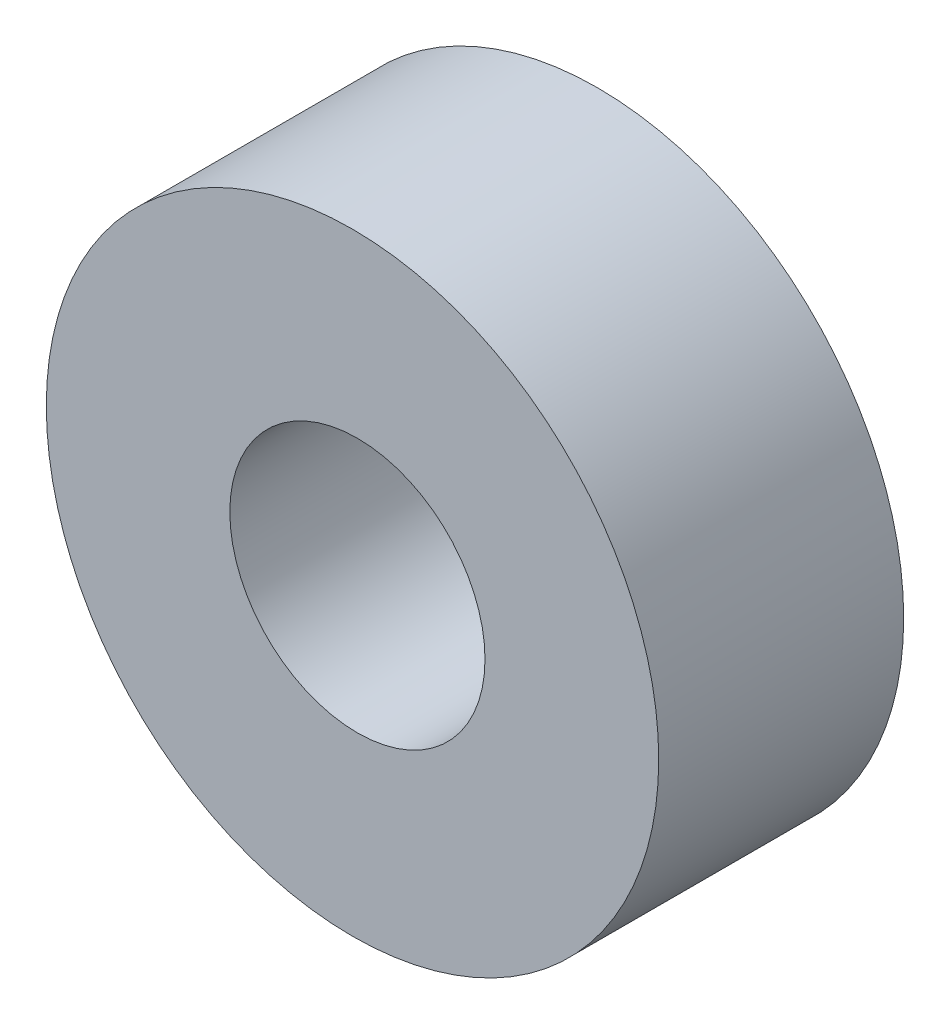
ISO-10303-21;
HEADER;
FILE_DESCRIPTION(('STEP AP214'),'2;1');
FILE_NAME('part.step','',(''),(''),'','','');
FILE_SCHEMA(('AUTOMOTIVE_DESIGN { 1 0 10303 214 1 1 1 1 }'));
ENDSEC;
DATA;
#1=APPLICATION_CONTEXT('core data for automotive mechanical design processes');
#2=APPLICATION_PROTOCOL_DEFINITION('international standard','automotive_design',2000,#1);
#3=PRODUCT_CONTEXT('',#1,'mechanical');
#4=PRODUCT('Part','Part','',(#3));
#5=PRODUCT_RELATED_PRODUCT_CATEGORY('part','',(#4));
#6=PRODUCT_DEFINITION_FORMATION('','',#4);
#7=PRODUCT_DEFINITION_CONTEXT('part definition',#1,'design');
#8=PRODUCT_DEFINITION('design','',#6,#7);
#9=PRODUCT_DEFINITION_SHAPE('','',#8);
#10=(LENGTH_UNIT() NAMED_UNIT(*) SI_UNIT(.MILLI.,.METRE.));
#11=(NAMED_UNIT(*) PLANE_ANGLE_UNIT() SI_UNIT($,.RADIAN.));
#12=(NAMED_UNIT(*) SI_UNIT($,.STERADIAN.) SOLID_ANGLE_UNIT());
#13=UNCERTAINTY_MEASURE_WITH_UNIT(LENGTH_MEASURE(1.E-05),#10,'distance_accuracy_value','');
#14=(GEOMETRIC_REPRESENTATION_CONTEXT(3) GLOBAL_UNCERTAINTY_ASSIGNED_CONTEXT((#13)) GLOBAL_UNIT_ASSIGNED_CONTEXT((#10,
#11,#12)) REPRESENTATION_CONTEXT('',''));
#15=CARTESIAN_POINT('',(0.,0.,0.));
#16=DIRECTION('',(0.,0.,1.));
#17=DIRECTION('',(1.,0.,0.));
#18=AXIS2_PLACEMENT_3D('',#15,#16,#17);
#19=CARTESIAN_POINT('',(-0.480006826812309,0.,24.));
#20=DIRECTION('',(0.,0.,1.));
#21=DIRECTION('',(1.,0.,0.));
#22=AXIS2_PLACEMENT_3D('',#19,#20,#21);
#23=PLANE('',#22);
#24=CARTESIAN_POINT('',(-0.480006826812309,0.,24.));
#25=DIRECTION('',(0.,0.,1.));
#26=DIRECTION('',(1.,0.,0.));
#27=AXIS2_PLACEMENT_3D('',#24,#25,#26);
#28=CIRCLE('',#27,30.);
#29=CARTESIAN_POINT('',(29.5199931731877,0.,24.));
#30=VERTEX_POINT('',#29);
#31=EDGE_CURVE('E10',#30,#30,#28,.T.);
#32=ORIENTED_EDGE('',*,*,#31,.T.);
#33=EDGE_LOOP('',(#32));
#34=FACE_BOUND('',#33,.T.);
#35=CARTESIAN_POINT('',(0.,0.,24.));
#36=DIRECTION('',(0.,0.,1.));
#37=DIRECTION('',(1.,0.,0.));
#38=AXIS2_PLACEMENT_3D('',#35,#36,#37);
#39=CIRCLE('',#38,12.5);
#40=CARTESIAN_POINT('',(12.5,0.,24.));
#41=VERTEX_POINT('',#40);
#42=EDGE_CURVE('E42',#41,#41,#39,.T.);
#43=ORIENTED_EDGE('',*,*,#42,.F.);
#44=EDGE_LOOP('',(#43));
#45=FACE_BOUND('',#44,.T.);
#46=ADVANCED_FACE('F31',(#34,#45),#23,.T.);
#47=CARTESIAN_POINT('',(-0.480006826812309,0.,0.));
#48=DIRECTION('',(0.,0.,1.));
#49=DIRECTION('',(1.,0.,0.));
#50=AXIS2_PLACEMENT_3D('',#47,#48,#49);
#51=PLANE('',#50);
#52=CARTESIAN_POINT('',(-0.480006826812309,0.,0.));
#53=DIRECTION('',(0.,0.,1.));
#54=DIRECTION('',(1.,0.,0.));
#55=AXIS2_PLACEMENT_3D('',#52,#53,#54);
#56=CIRCLE('',#55,30.);
#57=CARTESIAN_POINT('',(29.5199931731877,0.,0.));
#58=VERTEX_POINT('',#57);
#59=EDGE_CURVE('E35',#58,#58,#56,.T.);
#60=ORIENTED_EDGE('',*,*,#59,.F.);
#61=EDGE_LOOP('',(#60));
#62=FACE_BOUND('',#61,.T.);
#63=CARTESIAN_POINT('',(0.,0.,0.));
#64=DIRECTION('',(0.,0.,1.));
#65=DIRECTION('',(1.,0.,0.));
#66=AXIS2_PLACEMENT_3D('',#63,#64,#65);
#67=CIRCLE('',#66,12.5);
#68=CARTESIAN_POINT('',(12.5,0.,0.));
#69=VERTEX_POINT('',#68);
#70=EDGE_CURVE('E44',#69,#69,#67,.T.);
#71=ORIENTED_EDGE('',*,*,#70,.T.);
#72=EDGE_LOOP('',(#71));
#73=FACE_BOUND('',#72,.T.);
#74=ADVANCED_FACE('F54',(#62,#73),#51,.F.);
#75=CARTESIAN_POINT('',(-0.480006826812309,0.,24.));
#76=DIRECTION('',(0.,0.,-1.));
#77=DIRECTION('',(-1.,0.,0.));
#78=AXIS2_PLACEMENT_3D('',#75,#76,#77);
#79=CYLINDRICAL_SURFACE('',#78,30.);
#80=ORIENTED_EDGE('',*,*,#31,.F.);
#81=EDGE_LOOP('',(#80));
#82=FACE_BOUND('',#81,.T.);
#83=ORIENTED_EDGE('',*,*,#59,.T.);
#84=EDGE_LOOP('',(#83));
#85=FACE_BOUND('',#84,.T.);
#86=ADVANCED_FACE('F33',(#82,#85),#79,.T.);
#87=CARTESIAN_POINT('',(0.,0.,24.));
#88=DIRECTION('',(0.,0.,-1.));
#89=DIRECTION('',(-1.,0.,0.));
#90=AXIS2_PLACEMENT_3D('',#87,#88,#89);
#91=CYLINDRICAL_SURFACE('',#90,12.5);
#92=ORIENTED_EDGE('',*,*,#42,.T.);
#93=EDGE_LOOP('',(#92));
#94=FACE_BOUND('',#93,.T.);
#95=ORIENTED_EDGE('',*,*,#70,.F.);
#96=EDGE_LOOP('',(#95));
#97=FACE_BOUND('',#96,.T.);
#98=ADVANCED_FACE('F50',(#94,#97),#91,.F.);
#99=CLOSED_SHELL('',(#46,#74,#86,#98));
#100=MANIFOLD_SOLID_BREP('B2',#99);
#101=ADVANCED_BREP_SHAPE_REPRESENTATION('',(#18,#100),#14);
#102=SHAPE_DEFINITION_REPRESENTATION(#9,#101);
ENDSEC;
END-ISO-10303-21;
